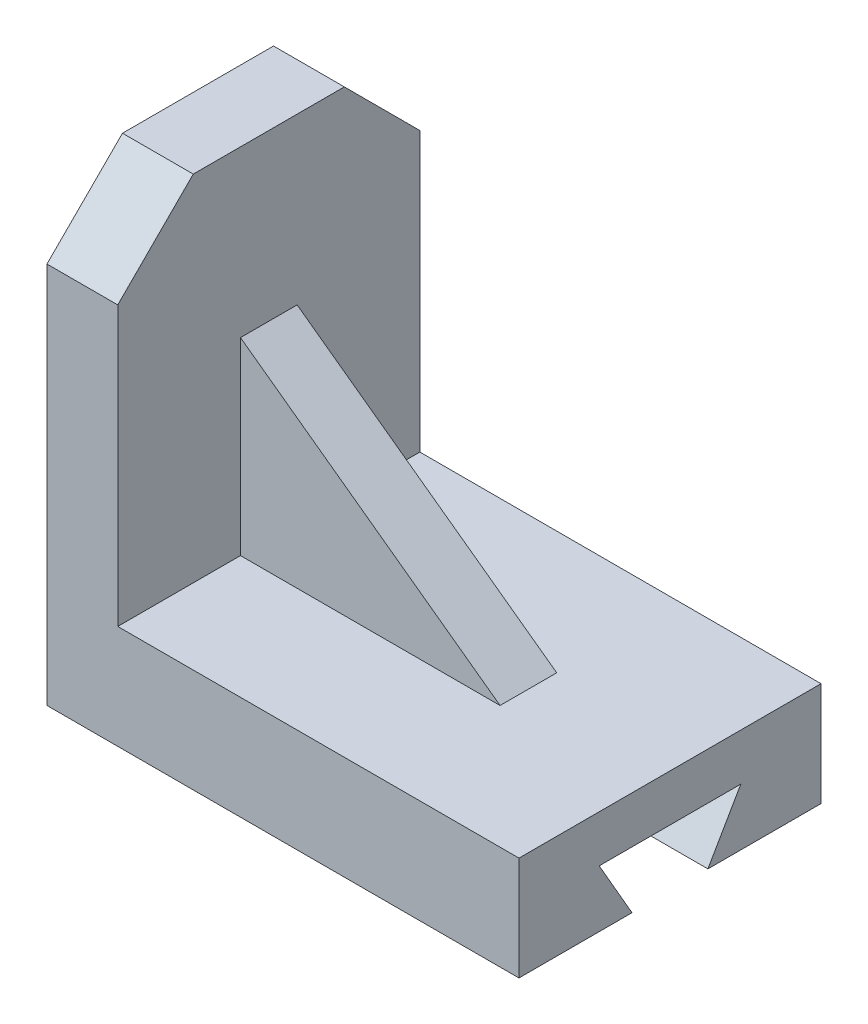
ISO-10303-21;
HEADER;
FILE_DESCRIPTION(('STEP AP214'),'2;1');
FILE_NAME('part.step','',(''),(''),'','','');
FILE_SCHEMA(('AUTOMOTIVE_DESIGN { 1 0 10303 214 1 1 1 1 }'));
ENDSEC;
DATA;
#1=APPLICATION_CONTEXT('core data for automotive mechanical design processes');
#2=APPLICATION_PROTOCOL_DEFINITION('international standard','automotive_design',2000,#1);
#3=PRODUCT_CONTEXT('',#1,'mechanical');
#4=PRODUCT('Part','Part','',(#3));
#5=PRODUCT_RELATED_PRODUCT_CATEGORY('part','',(#4));
#6=PRODUCT_DEFINITION_FORMATION('','',#4);
#7=PRODUCT_DEFINITION_CONTEXT('part definition',#1,'design');
#8=PRODUCT_DEFINITION('design','',#6,#7);
#9=PRODUCT_DEFINITION_SHAPE('','',#8);
#10=(LENGTH_UNIT() NAMED_UNIT(*) SI_UNIT(.MILLI.,.METRE.));
#11=(NAMED_UNIT(*) PLANE_ANGLE_UNIT() SI_UNIT($,.RADIAN.));
#12=(NAMED_UNIT(*) SI_UNIT($,.STERADIAN.) SOLID_ANGLE_UNIT());
#13=UNCERTAINTY_MEASURE_WITH_UNIT(LENGTH_MEASURE(1.E-05),#10,'distance_accuracy_value','');
#14=(GEOMETRIC_REPRESENTATION_CONTEXT(3) GLOBAL_UNCERTAINTY_ASSIGNED_CONTEXT((#13)) GLOBAL_UNIT_ASSIGNED_CONTEXT((#10,
#11,#12)) REPRESENTATION_CONTEXT('',''));
#15=CARTESIAN_POINT('',(0.,0.,0.));
#16=DIRECTION('',(0.,0.,1.));
#17=DIRECTION('',(1.,0.,0.));
#18=AXIS2_PLACEMENT_3D('',#15,#16,#17);
#19=CARTESIAN_POINT('',(0.,0.,0.));
#20=DIRECTION('',(0.,1.,0.));
#21=DIRECTION('',(0.,0.,1.));
#22=AXIS2_PLACEMENT_3D('',#19,#20,#21);
#23=PLANE('',#22);
#24=DIRECTION('',(0.,0.,1.));
#25=VECTOR('',#24,1.);
#26=CARTESIAN_POINT('',(-73.8522707826917,0.,-27.8305477109358));
#27=LINE('',#26,#25);
#28=CARTESIAN_POINT('',(-73.8522707826917,0.,12.217656654658));
#29=VERTEX_POINT('',#28);
#30=CARTESIAN_POINT('',(-73.8522707826917,0.,36.1694522890642));
#31=VERTEX_POINT('',#30);
#32=EDGE_CURVE('E192',#29,#31,#27,.T.);
#33=ORIENTED_EDGE('',*,*,#32,.F.);
#34=DIRECTION('',(1.,0.,0.));
#35=VECTOR('',#34,1.);
#36=CARTESIAN_POINT('',(0.,0.,12.217656654658));
#37=LINE('',#36,#35);
#38=CARTESIAN_POINT('',(26.1477292173083,0.,12.217656654658));
#39=VERTEX_POINT('',#38);
#40=EDGE_CURVE('E225',#29,#39,#37,.T.);
#41=ORIENTED_EDGE('',*,*,#40,.T.);
#42=DIRECTION('',(0.,0.,-1.));
#43=VECTOR('',#42,1.);
#44=CARTESIAN_POINT('',(26.1477292173083,0.,-27.8305477109358));
#45=LINE('',#44,#43);
#46=CARTESIAN_POINT('',(26.1477292173083,0.,36.1694522890642));
#47=VERTEX_POINT('',#46);
#48=EDGE_CURVE('E208',#47,#39,#45,.T.);
#49=ORIENTED_EDGE('',*,*,#48,.F.);
#50=DIRECTION('',(1.,0.,0.));
#51=VECTOR('',#50,1.);
#52=CARTESIAN_POINT('',(-73.8522707826917,0.,36.1694522890642));
#53=LINE('',#52,#51);
#54=EDGE_CURVE('E205',#31,#47,#53,.T.);
#55=ORIENTED_EDGE('',*,*,#54,.F.);
#56=EDGE_LOOP('',(#33,#41,#49,#55));
#57=FACE_BOUND('',#56,.T.);
#58=ADVANCED_FACE('F33',(#57),#23,.F.);
#59=CARTESIAN_POINT('',(-73.8522707826917,22.,-27.8305477109358));
#60=DIRECTION('',(1.,0.,0.));
#61=DIRECTION('',(0.,0.,-1.));
#62=AXIS2_PLACEMENT_3D('',#59,#60,#61);
#63=PLANE('',#62);
#64=DIRECTION('',(0.,-0.866025403784439,0.5));
#65=VECTOR('',#64,1.);
#66=CARTESIAN_POINT('',(-73.8522707826917,12.073281472568,-10.8305477109357));
#67=LINE('',#66,#65);
#68=CARTESIAN_POINT('',(-73.8522707826917,12.073281472568,-10.8305477109357));
#69=VERTEX_POINT('',#68);
#70=CARTESIAN_POINT('',(-73.8522707826917,0.,-3.86003540274647));
#71=VERTEX_POINT('',#70);
#72=EDGE_CURVE('E176',#69,#71,#67,.T.);
#73=ORIENTED_EDGE('',*,*,#72,.F.);
#74=DIRECTION('',(0.,0.,-1.));
#75=VECTOR('',#74,1.);
#76=CARTESIAN_POINT('',(-73.8522707826917,12.073281472568,-10.8305477109357));
#77=LINE('',#76,#75);
#78=CARTESIAN_POINT('',(-73.8522707826917,12.073281472568,19.1694522890643));
#79=VERTEX_POINT('',#78);
#80=EDGE_CURVE('E174',#79,#69,#77,.T.);
#81=ORIENTED_EDGE('',*,*,#80,.F.);
#82=DIRECTION('',(0.,0.866606553642445,0.498992065251508));
#83=VECTOR('',#82,1.);
#84=CARTESIAN_POINT('',(-73.8522707826917,12.073281472568,19.1694522890643));
#85=LINE('',#84,#83);
#86=EDGE_CURVE('E178',#29,#79,#85,.T.);
#87=ORIENTED_EDGE('',*,*,#86,.F.);
#88=ORIENTED_EDGE('',*,*,#32,.T.);
#89=DIRECTION('',(0.,-1.,0.));
#90=VECTOR('',#89,1.);
#91=CARTESIAN_POINT('',(-73.8522707826917,22.,36.1694522890642));
#92=LINE('',#91,#90);
#93=CARTESIAN_POINT('',(-73.8522707826917,80.9999999999999,36.1694522890642));
#94=VERTEX_POINT('',#93);
#95=EDGE_CURVE('E220',#94,#31,#92,.T.);
#96=ORIENTED_EDGE('',*,*,#95,.F.);
#97=DIRECTION('',(0.,0.707106781186548,-0.707106781186548));
#98=VECTOR('',#97,1.);
#99=CARTESIAN_POINT('',(-73.8522707826917,97.,20.1694522890641));
#100=LINE('',#99,#98);
#101=CARTESIAN_POINT('',(-73.8522707826917,97.,20.1694522890641));
#102=VERTEX_POINT('',#101);
#103=EDGE_CURVE('E238',#94,#102,#100,.T.);
#104=ORIENTED_EDGE('',*,*,#103,.T.);
#105=DIRECTION('',(0.,0.,1.));
#106=VECTOR('',#105,1.);
#107=CARTESIAN_POINT('',(-73.8522707826917,97.,-27.8305477109358));
#108=LINE('',#107,#106);
#109=CARTESIAN_POINT('',(-73.8522707826917,97.,-11.8305477109358));
#110=VERTEX_POINT('',#109);
#111=EDGE_CURVE('E162',#110,#102,#108,.T.);
#112=ORIENTED_EDGE('',*,*,#111,.F.);
#113=DIRECTION('',(0.,-0.707106781186548,-0.707106781186548));
#114=VECTOR('',#113,1.);
#115=CARTESIAN_POINT('',(-73.8522707826917,97.,-11.8305477109358));
#116=LINE('',#115,#114);
#117=CARTESIAN_POINT('',(-73.8522707826917,80.9999999999999,-27.8305477109358));
#118=VERTEX_POINT('',#117);
#119=EDGE_CURVE('E244',#110,#118,#116,.T.);
#120=ORIENTED_EDGE('',*,*,#119,.T.);
#121=DIRECTION('',(0.,-1.,0.));
#122=VECTOR('',#121,1.);
#123=CARTESIAN_POINT('',(-73.8522707826917,22.,-27.8305477109358));
#124=LINE('',#123,#122);
#125=CARTESIAN_POINT('',(-73.8522707826917,0.,-27.8305477109358));
#126=VERTEX_POINT('',#125);
#127=EDGE_CURVE('E201',#118,#126,#124,.T.);
#128=ORIENTED_EDGE('',*,*,#127,.T.);
#129=EDGE_CURVE('E202',#126,#71,#27,.T.);
#130=ORIENTED_EDGE('',*,*,#129,.T.);
#131=EDGE_LOOP('',(#73,#81,#87,#88,#96,#104,#112,#120,#128,#130));
#132=FACE_BOUND('',#131,.T.);
#133=ADVANCED_FACE('F261',(#132),#63,.F.);
#134=CARTESIAN_POINT('',(-73.8522707826917,22.,36.1694522890642));
#135=DIRECTION('',(0.,0.,-1.));
#136=DIRECTION('',(-1.,0.,0.));
#137=AXIS2_PLACEMENT_3D('',#134,#135,#136);
#138=PLANE('',#137);
#139=DIRECTION('',(0.,-1.,0.));
#140=VECTOR('',#139,1.);
#141=CARTESIAN_POINT('',(-58.8522707826917,97.,36.1694522890642));
#142=LINE('',#141,#140);
#143=CARTESIAN_POINT('',(-58.8522707826917,80.9999999999999,36.1694522890642));
#144=VERTEX_POINT('',#143);
#145=CARTESIAN_POINT('',(-58.8522707826917,22.,36.1694522890642));
#146=VERTEX_POINT('',#145);
#147=EDGE_CURVE('E172',#144,#146,#142,.T.);
#148=ORIENTED_EDGE('',*,*,#147,.F.);
#149=DIRECTION('',(-1.,0.,0.));
#150=VECTOR('',#149,1.);
#151=CARTESIAN_POINT('',(-73.8522707826917,80.9999999999999,36.1694522890642));
#152=LINE('',#151,#150);
#153=EDGE_CURVE('E236',#144,#94,#152,.T.);
#154=ORIENTED_EDGE('',*,*,#153,.T.);
#155=ORIENTED_EDGE('',*,*,#95,.T.);
#156=ORIENTED_EDGE('',*,*,#54,.T.);
#157=DIRECTION('',(0.,-1.,0.));
#158=VECTOR('',#157,1.);
#159=CARTESIAN_POINT('',(26.1477292173083,22.,36.1694522890642));
#160=LINE('',#159,#158);
#161=CARTESIAN_POINT('',(26.1477292173083,22.,36.1694522890642));
#162=VERTEX_POINT('',#161);
#163=EDGE_CURVE('E217',#162,#47,#160,.T.);
#164=ORIENTED_EDGE('',*,*,#163,.F.);
#165=DIRECTION('',(1.,0.,0.));
#166=VECTOR('',#165,1.);
#167=CARTESIAN_POINT('',(-73.8522707826917,22.,36.1694522890642));
#168=LINE('',#167,#166);
#169=EDGE_CURVE('E193',#146,#162,#168,.T.);
#170=ORIENTED_EDGE('',*,*,#169,.F.);
#171=EDGE_LOOP('',(#148,#154,#155,#156,#164,#170));
#172=FACE_BOUND('',#171,.T.);
#173=ADVANCED_FACE('F297',(#172),#138,.F.);
#174=CARTESIAN_POINT('',(26.1477292173083,22.,-27.8305477109358));
#175=DIRECTION('',(-1.,0.,0.));
#176=DIRECTION('',(0.,0.,1.));
#177=AXIS2_PLACEMENT_3D('',#174,#175,#176);
#178=PLANE('',#177);
#179=ORIENTED_EDGE('',*,*,#48,.T.);
#180=DIRECTION('',(0.,0.866606553642445,0.498992065251507));
#181=VECTOR('',#180,1.);
#182=CARTESIAN_POINT('',(26.1477292173083,-0.795884548430461,11.7593863209595));
#183=LINE('',#182,#181);
#184=CARTESIAN_POINT('',(26.1477292173083,12.073281472568,19.1694522890643));
#185=VERTEX_POINT('',#184);
#186=EDGE_CURVE('E189',#39,#185,#183,.T.);
#187=ORIENTED_EDGE('',*,*,#186,.T.);
#188=DIRECTION('',(0.,0.,-1.));
#189=VECTOR('',#188,1.);
#190=CARTESIAN_POINT('',(26.1477292173083,12.073281472568,-27.8305477109358));
#191=LINE('',#190,#189);
#192=CARTESIAN_POINT('',(26.1477292173083,12.073281472568,-10.8305477109357));
#193=VERTEX_POINT('',#192);
#194=EDGE_CURVE('E228',#185,#193,#191,.T.);
#195=ORIENTED_EDGE('',*,*,#194,.T.);
#196=DIRECTION('',(0.,-0.866025403784439,0.5));
#197=VECTOR('',#196,1.);
#198=CARTESIAN_POINT('',(26.1477292173083,26.8795363003098,-19.3789429214226));
#199=LINE('',#198,#197);
#200=CARTESIAN_POINT('',(26.1477292173083,0.,-3.86003540274647));
#201=VERTEX_POINT('',#200);
#202=EDGE_CURVE('E184',#193,#201,#199,.T.);
#203=ORIENTED_EDGE('',*,*,#202,.T.);
#204=CARTESIAN_POINT('',(26.1477292173083,0.,-27.8305477109358));
#205=VERTEX_POINT('',#204);
#206=EDGE_CURVE('E207',#201,#205,#45,.T.);
#207=ORIENTED_EDGE('',*,*,#206,.T.);
#208=DIRECTION('',(0.,-1.,0.));
#209=VECTOR('',#208,1.);
#210=CARTESIAN_POINT('',(26.1477292173083,22.,-27.8305477109358));
#211=LINE('',#210,#209);
#212=CARTESIAN_POINT('',(26.1477292173083,22.,-27.8305477109358));
#213=VERTEX_POINT('',#212);
#214=EDGE_CURVE('E214',#213,#205,#211,.T.);
#215=ORIENTED_EDGE('',*,*,#214,.F.);
#216=DIRECTION('',(0.,0.,-1.));
#217=VECTOR('',#216,1.);
#218=CARTESIAN_POINT('',(26.1477292173083,22.,-27.8305477109358));
#219=LINE('',#218,#217);
#220=EDGE_CURVE('E195',#162,#213,#219,.T.);
#221=ORIENTED_EDGE('',*,*,#220,.F.);
#222=ORIENTED_EDGE('',*,*,#163,.T.);
#223=EDGE_LOOP('',(#179,#187,#195,#203,#207,#215,#221,#222));
#224=FACE_BOUND('',#223,.T.);
#225=ADVANCED_FACE('F280',(#224),#178,.F.);
#226=CARTESIAN_POINT('',(-73.8522707826917,22.,-27.8305477109358));
#227=DIRECTION('',(0.,0.,1.));
#228=DIRECTION('',(1.,0.,0.));
#229=AXIS2_PLACEMENT_3D('',#226,#227,#228);
#230=PLANE('',#229);
#231=ORIENTED_EDGE('',*,*,#127,.F.);
#232=DIRECTION('',(1.,0.,0.));
#233=VECTOR('',#232,1.);
#234=CARTESIAN_POINT('',(-58.8522707826917,80.9999999999999,-27.8305477109358));
#235=LINE('',#234,#233);
#236=CARTESIAN_POINT('',(-58.8522707826917,80.9999999999999,-27.8305477109358));
#237=VERTEX_POINT('',#236);
#238=EDGE_CURVE('E246',#118,#237,#235,.T.);
#239=ORIENTED_EDGE('',*,*,#238,.T.);
#240=DIRECTION('',(0.,-1.,0.));
#241=VECTOR('',#240,1.);
#242=CARTESIAN_POINT('',(-58.8522707826917,97.,-27.8305477109358));
#243=LINE('',#242,#241);
#244=CARTESIAN_POINT('',(-58.8522707826917,22.,-27.8305477109358));
#245=VERTEX_POINT('',#244);
#246=EDGE_CURVE('E168',#237,#245,#243,.T.);
#247=ORIENTED_EDGE('',*,*,#246,.T.);
#248=DIRECTION('',(-1.,0.,0.));
#249=VECTOR('',#248,1.);
#250=CARTESIAN_POINT('',(-73.8522707826917,22.,-27.8305477109358));
#251=LINE('',#250,#249);
#252=EDGE_CURVE('E198',#213,#245,#251,.T.);
#253=ORIENTED_EDGE('',*,*,#252,.F.);
#254=ORIENTED_EDGE('',*,*,#214,.T.);
#255=DIRECTION('',(-1.,0.,0.));
#256=VECTOR('',#255,1.);
#257=CARTESIAN_POINT('',(-73.8522707826917,0.,-27.8305477109358));
#258=LINE('',#257,#256);
#259=EDGE_CURVE('E196',#205,#126,#258,.T.);
#260=ORIENTED_EDGE('',*,*,#259,.T.);
#261=EDGE_LOOP('',(#231,#239,#247,#253,#254,#260));
#262=FACE_BOUND('',#261,.T.);
#263=ADVANCED_FACE('F263',(#262),#230,.F.);
#264=CARTESIAN_POINT('',(0.,22.,0.));
#265=DIRECTION('',(0.,1.,0.));
#266=DIRECTION('',(0.,0.,1.));
#267=AXIS2_PLACEMENT_3D('',#264,#265,#266);
#268=PLANE('',#267);
#269=DIRECTION('',(1.,0.,0.));
#270=VECTOR('',#269,1.);
#271=CARTESIAN_POINT('',(0.,22.,10.1694522890642));
#272=LINE('',#271,#270);
#273=CARTESIAN_POINT('',(-58.8522707826917,22.,10.1694522890642));
#274=VERTEX_POINT('',#273);
#275=CARTESIAN_POINT('',(-3.85227078269172,22.,10.1694522890642));
#276=VERTEX_POINT('',#275);
#277=EDGE_CURVE('E158',#274,#276,#272,.T.);
#278=ORIENTED_EDGE('',*,*,#277,.F.);
#279=DIRECTION('',(0.,0.,-1.));
#280=VECTOR('',#279,1.);
#281=CARTESIAN_POINT('',(-58.8522707826917,22.,-27.8305477109358));
#282=LINE('',#281,#280);
#283=EDGE_CURVE('E165',#146,#274,#282,.T.);
#284=ORIENTED_EDGE('',*,*,#283,.F.);
#285=ORIENTED_EDGE('',*,*,#169,.T.);
#286=ORIENTED_EDGE('',*,*,#220,.T.);
#287=ORIENTED_EDGE('',*,*,#252,.T.);
#288=CARTESIAN_POINT('',(-58.8522707826917,22.,-1.83054771093583));
#289=VERTEX_POINT('',#288);
#290=EDGE_CURVE('E161',#289,#245,#282,.T.);
#291=ORIENTED_EDGE('',*,*,#290,.F.);
#292=DIRECTION('',(1.,0.,0.));
#293=VECTOR('',#292,1.);
#294=CARTESIAN_POINT('',(0.,22.,-1.83054771093583));
#295=LINE('',#294,#293);
#296=CARTESIAN_POINT('',(-3.85227078269172,22.,-1.83054771093583));
#297=VERTEX_POINT('',#296);
#298=EDGE_CURVE('E53',#289,#297,#295,.T.);
#299=ORIENTED_EDGE('',*,*,#298,.T.);
#300=DIRECTION('',(0.,0.,1.));
#301=VECTOR('',#300,1.);
#302=CARTESIAN_POINT('',(-3.85227078269172,22.,0.));
#303=LINE('',#302,#301);
#304=EDGE_CURVE('E48',#276,#297,#303,.F.);
#305=ORIENTED_EDGE('',*,*,#304,.F.);
#306=EDGE_LOOP('',(#278,#284,#285,#286,#287,#291,#299,#305));
#307=FACE_BOUND('',#306,.T.);
#308=ADVANCED_FACE('F300',(#307),#268,.T.);
#309=ORIENTED_EDGE('',*,*,#206,.F.);
#310=DIRECTION('',(-1.,0.,0.));
#311=VECTOR('',#310,1.);
#312=CARTESIAN_POINT('',(0.,0.,-3.86003540274647));
#313=LINE('',#312,#311);
#314=EDGE_CURVE('E222',#201,#71,#313,.T.);
#315=ORIENTED_EDGE('',*,*,#314,.T.);
#316=ORIENTED_EDGE('',*,*,#129,.F.);
#317=ORIENTED_EDGE('',*,*,#259,.F.);
#318=EDGE_LOOP('',(#309,#315,#316,#317));
#319=FACE_BOUND('',#318,.T.);
#320=ADVANCED_FACE('F270',(#319),#23,.F.);
#321=CARTESIAN_POINT('',(52.1477292173083,12.073281472568,-10.8305477109357));
#322=DIRECTION('',(0.,1.,0.));
#323=DIRECTION('',(0.,0.,1.));
#324=AXIS2_PLACEMENT_3D('',#321,#322,#323);
#325=PLANE('',#324);
#326=ORIENTED_EDGE('',*,*,#80,.T.);
#327=DIRECTION('',(-1.,0.,0.));
#328=VECTOR('',#327,1.);
#329=CARTESIAN_POINT('',(52.1477292173083,12.073281472568,-10.8305477109357));
#330=LINE('',#329,#328);
#331=EDGE_CURVE('E181',#193,#69,#330,.T.);
#332=ORIENTED_EDGE('',*,*,#331,.F.);
#333=ORIENTED_EDGE('',*,*,#194,.F.);
#334=DIRECTION('',(-1.,0.,0.));
#335=VECTOR('',#334,1.);
#336=CARTESIAN_POINT('',(52.1477292173083,12.073281472568,19.1694522890643));
#337=LINE('',#336,#335);
#338=EDGE_CURVE('E182',#185,#79,#337,.T.);
#339=ORIENTED_EDGE('',*,*,#338,.T.);
#340=EDGE_LOOP('',(#326,#332,#333,#339));
#341=FACE_BOUND('',#340,.T.);
#342=ADVANCED_FACE('F277',(#341),#325,.F.);
#343=CARTESIAN_POINT('',(52.1477292173083,12.073281472568,19.1694522890643));
#344=DIRECTION('',(0.,-0.498992065251507,0.866606553642445));
#345=DIRECTION('',(0.,-0.866606553642445,-0.498992065251507));
#346=AXIS2_PLACEMENT_3D('',#343,#344,#345);
#347=PLANE('',#346);
#348=ORIENTED_EDGE('',*,*,#40,.F.);
#349=ORIENTED_EDGE('',*,*,#86,.T.);
#350=ORIENTED_EDGE('',*,*,#338,.F.);
#351=ORIENTED_EDGE('',*,*,#186,.F.);
#352=EDGE_LOOP('',(#348,#349,#350,#351));
#353=FACE_BOUND('',#352,.T.);
#354=ADVANCED_FACE('F283',(#353),#347,.F.);
#355=CARTESIAN_POINT('',(52.1477292173083,12.073281472568,-10.8305477109357));
#356=DIRECTION('',(0.,-0.5,-0.866025403784439));
#357=DIRECTION('',(0.,0.866025403784439,-0.5));
#358=AXIS2_PLACEMENT_3D('',#355,#356,#357);
#359=PLANE('',#358);
#360=ORIENTED_EDGE('',*,*,#331,.T.);
#361=ORIENTED_EDGE('',*,*,#72,.T.);
#362=ORIENTED_EDGE('',*,*,#314,.F.);
#363=ORIENTED_EDGE('',*,*,#202,.F.);
#364=EDGE_LOOP('',(#360,#361,#362,#363));
#365=FACE_BOUND('',#364,.T.);
#366=ADVANCED_FACE('F274',(#365),#359,.F.);
#367=CARTESIAN_POINT('',(-58.8522707826917,97.,-27.8305477109358));
#368=DIRECTION('',(-1.,0.,0.));
#369=DIRECTION('',(0.,0.,1.));
#370=AXIS2_PLACEMENT_3D('',#367,#368,#369);
#371=PLANE('',#370);
#372=ORIENTED_EDGE('',*,*,#283,.T.);
#373=DIRECTION('',(0.,1.,0.));
#374=VECTOR('',#373,1.);
#375=CARTESIAN_POINT('',(-58.8522707826917,97.,10.1694522890642));
#376=LINE('',#375,#374);
#377=CARTESIAN_POINT('',(-58.8522707826917,62.,10.1694522890642));
#378=VERTEX_POINT('',#377);
#379=EDGE_CURVE('E11',#274,#378,#376,.T.);
#380=ORIENTED_EDGE('',*,*,#379,.T.);
#381=DIRECTION('',(0.,0.,1.));
#382=VECTOR('',#381,1.);
#383=CARTESIAN_POINT('',(-58.8522707826917,62.,-27.8305477109358));
#384=LINE('',#383,#382);
#385=CARTESIAN_POINT('',(-58.8522707826917,62.,-1.83054771093583));
#386=VERTEX_POINT('',#385);
#387=EDGE_CURVE('E41',#378,#386,#384,.F.);
#388=ORIENTED_EDGE('',*,*,#387,.T.);
#389=DIRECTION('',(0.,1.,0.));
#390=VECTOR('',#389,1.);
#391=CARTESIAN_POINT('',(-58.8522707826917,97.,-1.83054771093583));
#392=LINE('',#391,#390);
#393=EDGE_CURVE('E140',#289,#386,#392,.T.);
#394=ORIENTED_EDGE('',*,*,#393,.F.);
#395=ORIENTED_EDGE('',*,*,#290,.T.);
#396=ORIENTED_EDGE('',*,*,#246,.F.);
#397=DIRECTION('',(0.,0.707106781186548,0.707106781186548));
#398=VECTOR('',#397,1.);
#399=CARTESIAN_POINT('',(-58.8522707826917,97.,-11.8305477109358));
#400=LINE('',#399,#398);
#401=CARTESIAN_POINT('',(-58.8522707826917,97.,-11.8305477109358));
#402=VERTEX_POINT('',#401);
#403=EDGE_CURVE('E150',#237,#402,#400,.T.);
#404=ORIENTED_EDGE('',*,*,#403,.T.);
#405=DIRECTION('',(0.,0.,-1.));
#406=VECTOR('',#405,1.);
#407=CARTESIAN_POINT('',(-58.8522707826917,97.,-27.8305477109358));
#408=LINE('',#407,#406);
#409=CARTESIAN_POINT('',(-58.8522707826917,97.,20.1694522890641));
#410=VERTEX_POINT('',#409);
#411=EDGE_CURVE('E164',#410,#402,#408,.T.);
#412=ORIENTED_EDGE('',*,*,#411,.F.);
#413=DIRECTION('',(0.,-0.707106781186548,0.707106781186548));
#414=VECTOR('',#413,1.);
#415=CARTESIAN_POINT('',(-58.8522707826917,97.,20.1694522890641));
#416=LINE('',#415,#414);
#417=EDGE_CURVE('E234',#410,#144,#416,.T.);
#418=ORIENTED_EDGE('',*,*,#417,.T.);
#419=ORIENTED_EDGE('',*,*,#147,.T.);
#420=EDGE_LOOP('',(#372,#380,#388,#394,#395,#396,#404,#412,#418,#419));
#421=FACE_BOUND('',#420,.T.);
#422=ADVANCED_FACE('F139',(#421),#371,.F.);
#423=CARTESIAN_POINT('',(0.,97.,0.));
#424=DIRECTION('',(0.,1.,0.));
#425=DIRECTION('',(0.,0.,1.));
#426=AXIS2_PLACEMENT_3D('',#423,#424,#425);
#427=PLANE('',#426);
#428=ORIENTED_EDGE('',*,*,#411,.T.);
#429=DIRECTION('',(-1.,0.,0.));
#430=VECTOR('',#429,1.);
#431=CARTESIAN_POINT('',(-73.8522707826917,97.,-11.8305477109358));
#432=LINE('',#431,#430);
#433=EDGE_CURVE('E241',#402,#110,#432,.T.);
#434=ORIENTED_EDGE('',*,*,#433,.T.);
#435=ORIENTED_EDGE('',*,*,#111,.T.);
#436=DIRECTION('',(1.,0.,0.));
#437=VECTOR('',#436,1.);
#438=CARTESIAN_POINT('',(-58.8522707826917,97.,20.1694522890641));
#439=LINE('',#438,#437);
#440=EDGE_CURVE('E231',#102,#410,#439,.T.);
#441=ORIENTED_EDGE('',*,*,#440,.T.);
#442=EDGE_LOOP('',(#428,#434,#435,#441));
#443=FACE_BOUND('',#442,.T.);
#444=ADVANCED_FACE('F255',(#443),#427,.T.);
#445=CARTESIAN_POINT('',(0.,97.,20.1694522890641));
#446=DIRECTION('',(0.,0.707106781186548,0.707106781186548));
#447=DIRECTION('',(-1.,0.,0.));
#448=AXIS2_PLACEMENT_3D('',#445,#446,#447);
#449=PLANE('',#448);
#450=ORIENTED_EDGE('',*,*,#103,.F.);
#451=ORIENTED_EDGE('',*,*,#153,.F.);
#452=ORIENTED_EDGE('',*,*,#417,.F.);
#453=ORIENTED_EDGE('',*,*,#440,.F.);
#454=EDGE_LOOP('',(#450,#451,#452,#453));
#455=FACE_BOUND('',#454,.T.);
#456=ADVANCED_FACE('F293',(#455),#449,.T.);
#457=CARTESIAN_POINT('',(0.,97.,-11.8305477109358));
#458=DIRECTION('',(0.,0.707106781186548,-0.707106781186548));
#459=DIRECTION('',(1.,0.,0.));
#460=AXIS2_PLACEMENT_3D('',#457,#458,#459);
#461=PLANE('',#460);
#462=ORIENTED_EDGE('',*,*,#403,.F.);
#463=ORIENTED_EDGE('',*,*,#238,.F.);
#464=ORIENTED_EDGE('',*,*,#119,.F.);
#465=ORIENTED_EDGE('',*,*,#433,.F.);
#466=EDGE_LOOP('',(#462,#463,#464,#465));
#467=FACE_BOUND('',#466,.T.);
#468=ADVANCED_FACE('F35',(#467),#461,.T.);
#469=CARTESIAN_POINT('',(-58.8522707826917,62.,4.16945228906417));
#470=DIRECTION('',(-0.588171697675046,-0.808736084303189,0.));
#471=DIRECTION('',(0.808736084303189,-0.588171697675046,0.));
#472=AXIS2_PLACEMENT_3D('',#469,#470,#471);
#473=PLANE('',#472);
#474=DIRECTION('',(0.808736084303189,-0.588171697675046,0.));
#475=VECTOR('',#474,1.);
#476=CARTESIAN_POINT('',(-58.8522707826917,62.,10.1694522890642));
#477=LINE('',#476,#475);
#478=EDGE_CURVE('E153',#378,#276,#477,.T.);
#479=ORIENTED_EDGE('',*,*,#478,.T.);
#480=ORIENTED_EDGE('',*,*,#304,.T.);
#481=DIRECTION('',(0.808736084303189,-0.588171697675046,0.));
#482=VECTOR('',#481,1.);
#483=CARTESIAN_POINT('',(-58.8522707826917,62.,-1.83054771093583));
#484=LINE('',#483,#482);
#485=EDGE_CURVE('E149',#386,#297,#484,.T.);
#486=ORIENTED_EDGE('',*,*,#485,.F.);
#487=ORIENTED_EDGE('',*,*,#387,.F.);
#488=EDGE_LOOP('',(#479,#480,#486,#487));
#489=FACE_BOUND('',#488,.T.);
#490=ADVANCED_FACE('F152',(#489),#473,.F.);
#491=CARTESIAN_POINT('',(-23.8522707826917,48.5,10.1694522890642));
#492=DIRECTION('',(0.,0.,1.));
#493=DIRECTION('',(1.,0.,0.));
#494=AXIS2_PLACEMENT_3D('',#491,#492,#493);
#495=PLANE('',#494);
#496=ORIENTED_EDGE('',*,*,#379,.F.);
#497=ORIENTED_EDGE('',*,*,#277,.T.);
#498=ORIENTED_EDGE('',*,*,#478,.F.);
#499=EDGE_LOOP('',(#496,#497,#498));
#500=FACE_BOUND('',#499,.T.);
#501=ADVANCED_FACE('F302',(#500),#495,.T.);
#502=CARTESIAN_POINT('',(-23.8522707826917,48.5,-1.83054771093583));
#503=DIRECTION('',(0.,0.,1.));
#504=DIRECTION('',(1.,0.,0.));
#505=AXIS2_PLACEMENT_3D('',#502,#503,#504);
#506=PLANE('',#505);
#507=ORIENTED_EDGE('',*,*,#298,.F.);
#508=ORIENTED_EDGE('',*,*,#393,.T.);
#509=ORIENTED_EDGE('',*,*,#485,.T.);
#510=EDGE_LOOP('',(#507,#508,#509));
#511=FACE_BOUND('',#510,.T.);
#512=ADVANCED_FACE('F148',(#511),#506,.F.);
#513=CLOSED_SHELL('',(#58,#133,#173,#225,#263,#308,#320,#342,#354,#366,#422,#444,#456,#468,#490,
#501,#512));
#514=MANIFOLD_SOLID_BREP('B2',#513);
#515=ADVANCED_BREP_SHAPE_REPRESENTATION('',(#18,#514),#14);
#516=SHAPE_DEFINITION_REPRESENTATION(#9,#515);
ENDSEC;
END-ISO-10303-21;
